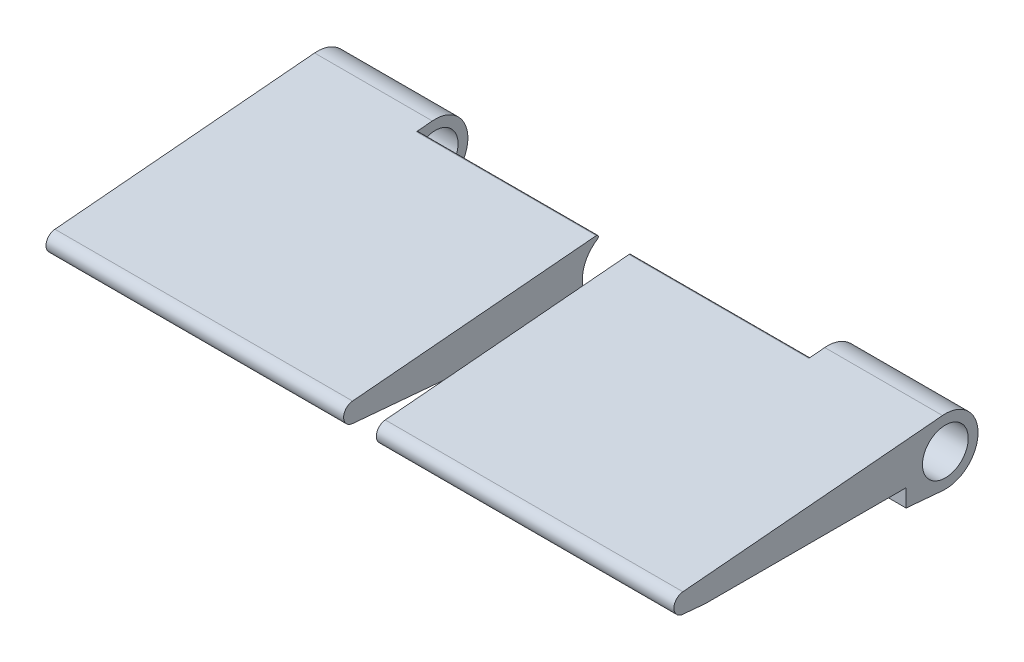
ISO-10303-21;
HEADER;
FILE_DESCRIPTION(('STEP AP214'),'2;1');
FILE_NAME('part.step','',(''),(''),'','','');
FILE_SCHEMA(('AUTOMOTIVE_DESIGN { 1 0 10303 214 1 1 1 1 }'));
ENDSEC;
DATA;
#1=APPLICATION_CONTEXT('core data for automotive mechanical design processes');
#2=APPLICATION_PROTOCOL_DEFINITION('international standard','automotive_design',2000,#1);
#3=PRODUCT_CONTEXT('',#1,'mechanical');
#4=PRODUCT('Part','Part','',(#3));
#5=PRODUCT_RELATED_PRODUCT_CATEGORY('part','',(#4));
#6=PRODUCT_DEFINITION_FORMATION('','',#4);
#7=PRODUCT_DEFINITION_CONTEXT('part definition',#1,'design');
#8=PRODUCT_DEFINITION('design','',#6,#7);
#9=PRODUCT_DEFINITION_SHAPE('','',#8);
#10=(LENGTH_UNIT() NAMED_UNIT(*) SI_UNIT(.MILLI.,.METRE.));
#11=(NAMED_UNIT(*) PLANE_ANGLE_UNIT() SI_UNIT($,.RADIAN.));
#12=(NAMED_UNIT(*) SI_UNIT($,.STERADIAN.) SOLID_ANGLE_UNIT());
#13=UNCERTAINTY_MEASURE_WITH_UNIT(LENGTH_MEASURE(1.E-05),#10,'distance_accuracy_value','');
#14=(GEOMETRIC_REPRESENTATION_CONTEXT(3) GLOBAL_UNCERTAINTY_ASSIGNED_CONTEXT((#13)) GLOBAL_UNIT_ASSIGNED_CONTEXT((#10,
#11,#12)) REPRESENTATION_CONTEXT('',''));
#15=CARTESIAN_POINT('',(0.,0.,0.));
#16=DIRECTION('',(0.,0.,1.));
#17=DIRECTION('',(1.,0.,0.));
#18=AXIS2_PLACEMENT_3D('',#15,#16,#17);
#19=CARTESIAN_POINT('',(32.5,-6.62708288224904,-18.304740975765));
#20=DIRECTION('',(0.,0.996164519544839,-0.0875));
#21=DIRECTION('',(0.,0.0875,0.996164519544839));
#22=AXIS2_PLACEMENT_3D('',#19,#20,#21);
#23=PLANE('',#22);
#24=DIRECTION('',(1.,0.,0.));
#25=VECTOR('',#24,1.);
#26=CARTESIAN_POINT('',(32.5000000000001,-1.8,36.6503298836491));
#27=LINE('',#26,#25);
#28=CARTESIAN_POINT('',(60.,-1.8,36.650329883649));
#29=VERTEX_POINT('',#28);
#30=CARTESIAN_POINT('',(78.,-1.8,36.650329883649));
#31=VERTEX_POINT('',#30);
#32=EDGE_CURVE('E140',#29,#31,#27,.T.);
#33=ORIENTED_EDGE('',*,*,#32,.T.);
#34=DIRECTION('',(0.,-0.0875,-0.996164519544839));
#35=VECTOR('',#34,1.);
#36=CARTESIAN_POINT('',(78.,-6.62708288224904,-18.304740975765));
#37=LINE('',#36,#35);
#38=CARTESIAN_POINT('',(78.,-1.49424677931726,40.13125));
#39=VERTEX_POINT('',#38);
#40=EDGE_CURVE('E158',#39,#31,#37,.T.);
#41=ORIENTED_EDGE('',*,*,#40,.F.);
#42=DIRECTION('',(1.,0.,0.));
#43=VECTOR('',#42,1.);
#44=CARTESIAN_POINT('',(32.5,-1.49424677931726,40.13125));
#45=LINE('',#44,#43);
#46=CARTESIAN_POINT('',(32.5,-1.49424677931726,40.13125));
#47=VERTEX_POINT('',#46);
#48=EDGE_CURVE('E187',#47,#39,#45,.T.);
#49=ORIENTED_EDGE('',*,*,#48,.F.);
#50=DIRECTION('',(0.,-0.0875,-0.996164519544839));
#51=VECTOR('',#50,1.);
#52=CARTESIAN_POINT('',(32.5,-6.62708288224904,-18.304740975765));
#53=LINE('',#52,#51);
#54=CARTESIAN_POINT('',(32.5,-4.76649224523067,2.87759477274962));
#55=VERTEX_POINT('',#54);
#56=EDGE_CURVE('E181',#47,#55,#53,.T.);
#57=ORIENTED_EDGE('',*,*,#56,.T.);
#58=DIRECTION('',(-1.,0.,0.));
#59=VECTOR('',#58,1.);
#60=CARTESIAN_POINT('',(32.5,-4.76649224523067,2.87759477274961));
#61=LINE('',#60,#59);
#62=CARTESIAN_POINT('',(60.,-4.76649224523067,2.87759477274961));
#63=VERTEX_POINT('',#62);
#64=EDGE_CURVE('E200',#63,#55,#61,.T.);
#65=ORIENTED_EDGE('',*,*,#64,.F.);
#66=DIRECTION('',(0.,0.0875,0.996164519544839));
#67=VECTOR('',#66,1.);
#68=CARTESIAN_POINT('',(60.,-6.62708288224904,-18.304740975765));
#69=LINE('',#68,#67);
#70=CARTESIAN_POINT('',(60.,-4.9808225977242,0.437499999999997));
#71=VERTEX_POINT('',#70);
#72=EDGE_CURVE('E203',#71,#63,#69,.T.);
#73=ORIENTED_EDGE('',*,*,#72,.F.);
#74=DIRECTION('',(-1.,0.,0.));
#75=VECTOR('',#74,1.);
#76=CARTESIAN_POINT('',(78.,-4.9808225977242,0.437499999999997));
#77=LINE('',#76,#75);
#78=CARTESIAN_POINT('',(78.,-4.9808225977242,0.437499999999997));
#79=VERTEX_POINT('',#78);
#80=EDGE_CURVE('E167',#79,#71,#77,.T.);
#81=ORIENTED_EDGE('',*,*,#80,.F.);
#82=CARTESIAN_POINT('',(78.,-4.49222985982746,6.));
#83=VERTEX_POINT('',#82);
#84=EDGE_CURVE('E157',#83,#79,#37,.T.);
#85=ORIENTED_EDGE('',*,*,#84,.F.);
#86=DIRECTION('',(-1.,0.,0.));
#87=VECTOR('',#86,1.);
#88=CARTESIAN_POINT('',(32.5,-4.49222985982746,6.));
#89=LINE('',#88,#87);
#90=CARTESIAN_POINT('',(60.,-4.49222985982746,6.));
#91=VERTEX_POINT('',#90);
#92=EDGE_CURVE('E142',#83,#91,#89,.T.);
#93=ORIENTED_EDGE('',*,*,#92,.T.);
#94=DIRECTION('',(0.,0.0875,0.996164519544839));
#95=VECTOR('',#94,1.);
#96=CARTESIAN_POINT('',(60.,-6.62708288224904,-18.304740975765));
#97=LINE('',#96,#95);
#98=EDGE_CURVE('E12',#91,#29,#97,.T.);
#99=ORIENTED_EDGE('',*,*,#98,.T.);
#100=EDGE_LOOP('',(#33,#41,#49,#57,#65,#73,#81,#85,#93,#99));
#101=FACE_BOUND('',#100,.T.);
#102=ADVANCED_FACE('F46',(#101),#23,.F.);
#103=CARTESIAN_POINT('',(78.,0.,-18.886843370319));
#104=DIRECTION('',(-1.,0.,0.));
#105=DIRECTION('',(0.,0.,-1.));
#106=AXIS2_PLACEMENT_3D('',#103,#104,#105);
#107=PLANE('',#106);
#108=CARTESIAN_POINT('',(78.,0.,0.));
#109=DIRECTION('',(1.,0.,0.));
#110=DIRECTION('',(0.,0.,-1.));
#111=AXIS2_PLACEMENT_3D('',#108,#109,#110);
#112=CIRCLE('',#111,3.5);
#113=CARTESIAN_POINT('',(78.,0.,-3.5));
#114=VERTEX_POINT('',#113);
#115=EDGE_CURVE('E164',#114,#114,#112,.T.);
#116=ORIENTED_EDGE('',*,*,#115,.F.);
#117=EDGE_LOOP('',(#116));
#118=FACE_BOUND('',#117,.T.);
#119=DIRECTION('',(0.,0.,-1.));
#120=VECTOR('',#119,1.);
#121=CARTESIAN_POINT('',(78.,-1.8,-18.886843370319));
#122=LINE('',#121,#120);
#123=CARTESIAN_POINT('',(78.,-1.8,6.));
#124=VERTEX_POINT('',#123);
#125=EDGE_CURVE('E54',#31,#124,#122,.T.);
#126=ORIENTED_EDGE('',*,*,#125,.T.);
#127=DIRECTION('',(0.,-1.,0.));
#128=VECTOR('',#127,1.);
#129=CARTESIAN_POINT('',(78.,-6.13028373982871,6.));
#130=LINE('',#129,#128);
#131=EDGE_CURVE('E133',#124,#83,#130,.T.);
#132=ORIENTED_EDGE('',*,*,#131,.T.);
#133=ORIENTED_EDGE('',*,*,#84,.T.);
#134=CARTESIAN_POINT('',(78.,0.,0.));
#135=DIRECTION('',(1.,0.,0.));
#136=DIRECTION('',(0.,0.,-1.));
#137=AXIS2_PLACEMENT_3D('',#134,#135,#136);
#138=CIRCLE('',#137,5.);
#139=CARTESIAN_POINT('',(78.,4.9808225977242,0.437499999999997));
#140=VERTEX_POINT('',#139);
#141=EDGE_CURVE('E161',#79,#140,#138,.T.);
#142=ORIENTED_EDGE('',*,*,#141,.T.);
#143=DIRECTION('',(0.,0.0875,-0.996164519544839));
#144=VECTOR('',#143,1.);
#145=CARTESIAN_POINT('',(78.,6.62708288224904,-18.304740975765));
#146=LINE('',#145,#144);
#147=CARTESIAN_POINT('',(78.,1.49424677931726,40.13125));
#148=VERTEX_POINT('',#147);
#149=EDGE_CURVE('E151',#148,#140,#146,.T.);
#150=ORIENTED_EDGE('',*,*,#149,.F.);
#151=CARTESIAN_POINT('',(78.,0.,40.));
#152=DIRECTION('',(1.,0.,0.));
#153=DIRECTION('',(0.,0.,-1.));
#154=AXIS2_PLACEMENT_3D('',#151,#152,#153);
#155=CIRCLE('',#154,1.5);
#156=EDGE_CURVE('E154',#148,#39,#155,.T.);
#157=ORIENTED_EDGE('',*,*,#156,.T.);
#158=ORIENTED_EDGE('',*,*,#40,.T.);
#159=EDGE_LOOP('',(#126,#132,#133,#142,#150,#157,#158));
#160=FACE_BOUND('',#159,.T.);
#161=ADVANCED_FACE('F218',(#118,#160),#107,.F.);
#162=CARTESIAN_POINT('',(32.5,6.62708288224904,-18.304740975765));
#163=DIRECTION('',(0.,0.996164519544839,0.0875));
#164=DIRECTION('',(0.,-0.0875,0.996164519544839));
#165=AXIS2_PLACEMENT_3D('',#162,#163,#164);
#166=PLANE('',#165);
#167=DIRECTION('',(0.,0.0875,-0.996164519544839));
#168=VECTOR('',#167,1.);
#169=CARTESIAN_POINT('',(32.5,6.62708288224904,-18.304740975765));
#170=LINE('',#169,#168);
#171=CARTESIAN_POINT('',(32.5,1.49424677931726,40.13125));
#172=VERTEX_POINT('',#171);
#173=CARTESIAN_POINT('',(32.5,4.76649224523067,2.87759477274962));
#174=VERTEX_POINT('',#173);
#175=EDGE_CURVE('E176',#172,#174,#170,.T.);
#176=ORIENTED_EDGE('',*,*,#175,.F.);
#177=DIRECTION('',(1.,0.,0.));
#178=VECTOR('',#177,1.);
#179=CARTESIAN_POINT('',(32.5,1.49424677931726,40.13125));
#180=LINE('',#179,#178);
#181=EDGE_CURVE('E192',#172,#148,#180,.T.);
#182=ORIENTED_EDGE('',*,*,#181,.T.);
#183=ORIENTED_EDGE('',*,*,#149,.T.);
#184=DIRECTION('',(-1.,0.,0.));
#185=VECTOR('',#184,1.);
#186=CARTESIAN_POINT('',(78.,4.9808225977242,0.437499999999997));
#187=LINE('',#186,#185);
#188=CARTESIAN_POINT('',(60.,4.9808225977242,0.437499999999997));
#189=VERTEX_POINT('',#188);
#190=EDGE_CURVE('E171',#140,#189,#187,.T.);
#191=ORIENTED_EDGE('',*,*,#190,.T.);
#192=DIRECTION('',(0.,0.0875,-0.996164519544839));
#193=VECTOR('',#192,1.);
#194=CARTESIAN_POINT('',(60.,6.62708288224904,-18.304740975765));
#195=LINE('',#194,#193);
#196=CARTESIAN_POINT('',(60.,4.76649224523067,2.87759477274961));
#197=VERTEX_POINT('',#196);
#198=EDGE_CURVE('E209',#197,#189,#195,.T.);
#199=ORIENTED_EDGE('',*,*,#198,.F.);
#200=DIRECTION('',(1.,0.,0.));
#201=VECTOR('',#200,1.);
#202=CARTESIAN_POINT('',(32.5,4.76649224523067,2.87759477274962));
#203=LINE('',#202,#201);
#204=EDGE_CURVE('E211',#174,#197,#203,.T.);
#205=ORIENTED_EDGE('',*,*,#204,.F.);
#206=EDGE_LOOP('',(#176,#182,#183,#191,#199,#205));
#207=FACE_BOUND('',#206,.T.);
#208=ADVANCED_FACE('F233',(#207),#166,.T.);
#209=CARTESIAN_POINT('',(32.5,0.,40.));
#210=DIRECTION('',(1.,0.,0.));
#211=DIRECTION('',(0.,0.,1.));
#212=AXIS2_PLACEMENT_3D('',#209,#210,#211);
#213=CYLINDRICAL_SURFACE('',#212,1.5);
#214=ORIENTED_EDGE('',*,*,#181,.F.);
#215=CARTESIAN_POINT('',(32.5,0.,40.));
#216=DIRECTION('',(1.,0.,0.));
#217=DIRECTION('',(0.,0.,-1.));
#218=AXIS2_PLACEMENT_3D('',#215,#216,#217);
#219=CIRCLE('',#218,1.5);
#220=EDGE_CURVE('E179',#172,#47,#219,.T.);
#221=ORIENTED_EDGE('',*,*,#220,.T.);
#222=ORIENTED_EDGE('',*,*,#48,.T.);
#223=ORIENTED_EDGE('',*,*,#156,.F.);
#224=EDGE_LOOP('',(#214,#221,#222,#223));
#225=FACE_BOUND('',#224,.T.);
#226=ADVANCED_FACE('F237',(#225),#213,.T.);
#227=CARTESIAN_POINT('',(32.5,0.,0.));
#228=DIRECTION('',(1.,0.,0.));
#229=DIRECTION('',(0.,0.,1.));
#230=AXIS2_PLACEMENT_3D('',#227,#228,#229);
#231=CYLINDRICAL_SURFACE('',#230,5.);
#232=CARTESIAN_POINT('',(32.5,0.,0.));
#233=DIRECTION('',(1.,0.,0.));
#234=DIRECTION('',(0.,0.,-1.));
#235=AXIS2_PLACEMENT_3D('',#232,#233,#234);
#236=CIRCLE('',#235,5.);
#237=CARTESIAN_POINT('',(32.5,4.21475744279926,2.68994789882039));
#238=VERTEX_POINT('',#237);
#239=CARTESIAN_POINT('',(32.5,-4.21475744279926,2.68994789882039));
#240=VERTEX_POINT('',#239);
#241=EDGE_CURVE('E184',#238,#240,#236,.T.);
#242=ORIENTED_EDGE('',*,*,#241,.F.);
#243=DIRECTION('',(1.,0.,0.));
#244=VECTOR('',#243,1.);
#245=CARTESIAN_POINT('',(32.5,4.21475744279926,2.68994789882039));
#246=LINE('',#245,#244);
#247=CARTESIAN_POINT('',(60.,4.21475744279926,2.68994789882039));
#248=VERTEX_POINT('',#247);
#249=EDGE_CURVE('E194',#248,#238,#246,.F.);
#250=ORIENTED_EDGE('',*,*,#249,.F.);
#251=CARTESIAN_POINT('',(60.,0.,0.));
#252=DIRECTION('',(1.,0.,0.));
#253=DIRECTION('',(0.,0.,-1.));
#254=AXIS2_PLACEMENT_3D('',#251,#252,#253);
#255=CIRCLE('',#254,5.);
#256=CARTESIAN_POINT('',(60.,-4.21475744279926,2.68994789882039));
#257=VERTEX_POINT('',#256);
#258=EDGE_CURVE('E174',#248,#257,#255,.T.);
#259=ORIENTED_EDGE('',*,*,#258,.T.);
#260=DIRECTION('',(1.,0.,0.));
#261=VECTOR('',#260,1.);
#262=CARTESIAN_POINT('',(32.5,-4.21475744279926,2.68994789882039));
#263=LINE('',#262,#261);
#264=EDGE_CURVE('E197',#240,#257,#263,.T.);
#265=ORIENTED_EDGE('',*,*,#264,.F.);
#266=EDGE_LOOP('',(#242,#250,#259,#265));
#267=FACE_BOUND('',#266,.T.);
#268=ADVANCED_FACE('F270',(#267),#231,.F.);
#269=CARTESIAN_POINT('',(32.5,0.,-18.886843370319));
#270=DIRECTION('',(-1.,0.,0.));
#271=DIRECTION('',(0.,0.,-1.));
#272=AXIS2_PLACEMENT_3D('',#269,#270,#271);
#273=PLANE('',#272);
#274=ORIENTED_EDGE('',*,*,#56,.F.);
#275=ORIENTED_EDGE('',*,*,#220,.F.);
#276=ORIENTED_EDGE('',*,*,#175,.T.);
#277=CARTESIAN_POINT('',(32.5,4.46764288936722,2.85134477274961));
#278=DIRECTION('',(1.,0.,0.));
#279=DIRECTION('',(0.,0.,-1.));
#280=AXIS2_PLACEMENT_3D('',#277,#278,#279);
#281=CIRCLE('',#280,0.3);
#282=EDGE_CURVE('E205',#238,#174,#281,.T.);
#283=ORIENTED_EDGE('',*,*,#282,.F.);
#284=ORIENTED_EDGE('',*,*,#241,.T.);
#285=CARTESIAN_POINT('',(32.5,-4.46764288936722,2.85134477274961));
#286=DIRECTION('',(1.,0.,0.));
#287=DIRECTION('',(0.,0.,-1.));
#288=AXIS2_PLACEMENT_3D('',#285,#286,#287);
#289=CIRCLE('',#288,0.3);
#290=EDGE_CURVE('E207',#55,#240,#289,.T.);
#291=ORIENTED_EDGE('',*,*,#290,.F.);
#292=EDGE_LOOP('',(#274,#275,#276,#283,#284,#291));
#293=FACE_BOUND('',#292,.T.);
#294=ADVANCED_FACE('F241',(#293),#273,.T.);
#295=CARTESIAN_POINT('',(78.,0.,0.));
#296=DIRECTION('',(-1.,0.,0.));
#297=DIRECTION('',(0.,0.,-1.));
#298=AXIS2_PLACEMENT_3D('',#295,#296,#297);
#299=CYLINDRICAL_SURFACE('',#298,5.);
#300=CARTESIAN_POINT('',(60.,0.,0.));
#301=DIRECTION('',(1.,0.,0.));
#302=DIRECTION('',(0.,0.,-1.));
#303=AXIS2_PLACEMENT_3D('',#300,#301,#302);
#304=CIRCLE('',#303,5.);
#305=EDGE_CURVE('E69',#71,#189,#304,.T.);
#306=ORIENTED_EDGE('',*,*,#305,.T.);
#307=ORIENTED_EDGE('',*,*,#190,.F.);
#308=ORIENTED_EDGE('',*,*,#141,.F.);
#309=ORIENTED_EDGE('',*,*,#80,.T.);
#310=EDGE_LOOP('',(#306,#307,#308,#309));
#311=FACE_BOUND('',#310,.T.);
#312=ADVANCED_FACE('F229',(#311),#299,.T.);
#313=CARTESIAN_POINT('',(78.,0.,0.));
#314=DIRECTION('',(-1.,0.,0.));
#315=DIRECTION('',(0.,0.,-1.));
#316=AXIS2_PLACEMENT_3D('',#313,#314,#315);
#317=CYLINDRICAL_SURFACE('',#316,3.5);
#318=ORIENTED_EDGE('',*,*,#115,.T.);
#319=EDGE_LOOP('',(#318));
#320=FACE_BOUND('',#319,.T.);
#321=CARTESIAN_POINT('',(60.,0.,0.));
#322=DIRECTION('',(1.,0.,0.));
#323=DIRECTION('',(0.,0.,-1.));
#324=AXIS2_PLACEMENT_3D('',#321,#322,#323);
#325=CIRCLE('',#324,3.5);
#326=CARTESIAN_POINT('',(60.,0.,-3.5));
#327=VERTEX_POINT('',#326);
#328=EDGE_CURVE('E155',#327,#327,#325,.T.);
#329=ORIENTED_EDGE('',*,*,#328,.F.);
#330=EDGE_LOOP('',(#329));
#331=FACE_BOUND('',#330,.T.);
#332=ADVANCED_FACE('F250',(#320,#331),#317,.F.);
#333=CARTESIAN_POINT('',(60.,0.,-18.886843370319));
#334=DIRECTION('',(-1.,0.,0.));
#335=DIRECTION('',(0.,0.,-1.));
#336=AXIS2_PLACEMENT_3D('',#333,#334,#335);
#337=PLANE('',#336);
#338=ORIENTED_EDGE('',*,*,#305,.F.);
#339=ORIENTED_EDGE('',*,*,#72,.T.);
#340=CARTESIAN_POINT('',(60.,-4.46764288936722,2.85134477274961));
#341=DIRECTION('',(1.,0.,0.));
#342=DIRECTION('',(0.,0.,-1.));
#343=AXIS2_PLACEMENT_3D('',#340,#341,#342);
#344=CIRCLE('',#343,0.3);
#345=EDGE_CURVE('E214',#257,#63,#344,.F.);
#346=ORIENTED_EDGE('',*,*,#345,.F.);
#347=ORIENTED_EDGE('',*,*,#258,.F.);
#348=CARTESIAN_POINT('',(60.,4.46764288936722,2.85134477274961));
#349=DIRECTION('',(1.,0.,0.));
#350=DIRECTION('',(0.,0.,-1.));
#351=AXIS2_PLACEMENT_3D('',#348,#349,#350);
#352=CIRCLE('',#351,0.3);
#353=EDGE_CURVE('E216',#197,#248,#352,.F.);
#354=ORIENTED_EDGE('',*,*,#353,.F.);
#355=ORIENTED_EDGE('',*,*,#198,.T.);
#356=EDGE_LOOP('',(#338,#339,#346,#347,#354,#355));
#357=FACE_BOUND('',#356,.T.);
#358=ORIENTED_EDGE('',*,*,#328,.T.);
#359=EDGE_LOOP('',(#358));
#360=FACE_BOUND('',#359,.T.);
#361=ADVANCED_FACE('F247',(#357,#360),#337,.T.);
#362=CARTESIAN_POINT('',(32.5,-4.46764288936722,2.85134477274961));
#363=DIRECTION('',(1.,0.,0.));
#364=DIRECTION('',(0.,0.,1.));
#365=AXIS2_PLACEMENT_3D('',#362,#363,#364);
#366=CYLINDRICAL_SURFACE('',#365,0.3);
#367=ORIENTED_EDGE('',*,*,#290,.T.);
#368=ORIENTED_EDGE('',*,*,#264,.T.);
#369=ORIENTED_EDGE('',*,*,#345,.T.);
#370=ORIENTED_EDGE('',*,*,#64,.T.);
#371=EDGE_LOOP('',(#367,#368,#369,#370));
#372=FACE_BOUND('',#371,.T.);
#373=ADVANCED_FACE('F245',(#372),#366,.T.);
#374=CARTESIAN_POINT('',(32.5,4.46764288936722,2.85134477274961));
#375=DIRECTION('',(1.,0.,0.));
#376=DIRECTION('',(0.,0.,1.));
#377=AXIS2_PLACEMENT_3D('',#374,#375,#376);
#378=CYLINDRICAL_SURFACE('',#377,0.3);
#379=ORIENTED_EDGE('',*,*,#282,.T.);
#380=ORIENTED_EDGE('',*,*,#204,.T.);
#381=ORIENTED_EDGE('',*,*,#353,.T.);
#382=ORIENTED_EDGE('',*,*,#249,.T.);
#383=EDGE_LOOP('',(#379,#380,#381,#382));
#384=FACE_BOUND('',#383,.T.);
#385=ADVANCED_FACE('F48',(#384),#378,.T.);
#386=CARTESIAN_POINT('',(60.,-6.13028373982871,54.));
#387=DIRECTION('',(1.,0.,0.));
#388=DIRECTION('',(0.,0.,1.));
#389=AXIS2_PLACEMENT_3D('',#386,#387,#388);
#390=PLANE('',#389);
#391=ORIENTED_EDGE('',*,*,#98,.F.);
#392=DIRECTION('',(0.,1.,0.));
#393=VECTOR('',#392,1.);
#394=CARTESIAN_POINT('',(60.,-6.13028373982871,6.));
#395=LINE('',#394,#393);
#396=CARTESIAN_POINT('',(60.,-1.8,6.));
#397=VERTEX_POINT('',#396);
#398=EDGE_CURVE('E131',#91,#397,#395,.T.);
#399=ORIENTED_EDGE('',*,*,#398,.T.);
#400=DIRECTION('',(0.,0.,-1.));
#401=VECTOR('',#400,1.);
#402=CARTESIAN_POINT('',(60.,-1.8,54.));
#403=LINE('',#402,#401);
#404=EDGE_CURVE('E137',#29,#397,#403,.T.);
#405=ORIENTED_EDGE('',*,*,#404,.F.);
#406=EDGE_LOOP('',(#391,#399,#405));
#407=FACE_BOUND('',#406,.T.);
#408=ADVANCED_FACE('F144',(#407),#390,.T.);
#409=CARTESIAN_POINT('',(60.,-1.8,54.));
#410=DIRECTION('',(0.,-1.,0.));
#411=DIRECTION('',(-1.,0.,0.));
#412=AXIS2_PLACEMENT_3D('',#409,#410,#411);
#413=PLANE('',#412);
#414=ORIENTED_EDGE('',*,*,#32,.F.);
#415=ORIENTED_EDGE('',*,*,#404,.T.);
#416=DIRECTION('',(1.,0.,0.));
#417=VECTOR('',#416,1.);
#418=CARTESIAN_POINT('',(60.,-1.8,6.));
#419=LINE('',#418,#417);
#420=EDGE_CURVE('E61',#397,#124,#419,.T.);
#421=ORIENTED_EDGE('',*,*,#420,.T.);
#422=ORIENTED_EDGE('',*,*,#125,.F.);
#423=EDGE_LOOP('',(#414,#415,#421,#422));
#424=FACE_BOUND('',#423,.T.);
#425=ADVANCED_FACE('F138',(#424),#413,.T.);
#426=CARTESIAN_POINT('',(60.,-1.8,6.));
#427=DIRECTION('',(0.,0.,1.));
#428=DIRECTION('',(-1.,0.,0.));
#429=AXIS2_PLACEMENT_3D('',#426,#427,#428);
#430=PLANE('',#429);
#431=ORIENTED_EDGE('',*,*,#92,.F.);
#432=ORIENTED_EDGE('',*,*,#131,.F.);
#433=ORIENTED_EDGE('',*,*,#420,.F.);
#434=ORIENTED_EDGE('',*,*,#398,.F.);
#435=EDGE_LOOP('',(#431,#432,#433,#434));
#436=FACE_BOUND('',#435,.T.);
#437=ADVANCED_FACE('F129',(#436),#430,.T.);
#438=CLOSED_SHELL('',(#102,#161,#208,#226,#268,#294,#312,#332,#361,#373,#385,#408,#425,#437));
#439=MANIFOLD_SOLID_BREP('B2',#438);
#440=CARTESIAN_POINT('',(27.5,-6.62708288224904,-18.304740975765));
#441=DIRECTION('',(0.,0.996164519544839,-0.0875));
#442=DIRECTION('',(0.,0.0875,0.996164519544839));
#443=AXIS2_PLACEMENT_3D('',#440,#441,#442);
#444=PLANE('',#443);
#445=DIRECTION('',(-1.,0.,0.));
#446=VECTOR('',#445,1.);
#447=CARTESIAN_POINT('',(27.4999999999999,-1.8,36.6503298836491));
#448=LINE('',#447,#446);
#449=CARTESIAN_POINT('',(0.,-1.8,36.650329883649));
#450=VERTEX_POINT('',#449);
#451=CARTESIAN_POINT('',(-18.,-1.8,36.650329883649));
#452=VERTEX_POINT('',#451);
#453=EDGE_CURVE('E498',#450,#452,#448,.T.);
#454=ORIENTED_EDGE('',*,*,#453,.F.);
#455=DIRECTION('',(0.,0.0875,0.996164519544839));
#456=VECTOR('',#455,1.);
#457=CARTESIAN_POINT('',(0.,-6.62708288224904,-18.304740975765));
#458=LINE('',#457,#456);
#459=CARTESIAN_POINT('',(0.,-4.49222985982746,6.));
#460=VERTEX_POINT('',#459);
#461=EDGE_CURVE('E44',#460,#450,#458,.T.);
#462=ORIENTED_EDGE('',*,*,#461,.F.);
#463=DIRECTION('',(1.,0.,0.));
#464=VECTOR('',#463,1.);
#465=CARTESIAN_POINT('',(27.5,-4.49222985982746,6.));
#466=LINE('',#465,#464);
#467=CARTESIAN_POINT('',(-18.,-4.49222985982746,6.));
#468=VERTEX_POINT('',#467);
#469=EDGE_CURVE('E485',#468,#460,#466,.T.);
#470=ORIENTED_EDGE('',*,*,#469,.F.);
#471=DIRECTION('',(0.,-0.0875,-0.996164519544839));
#472=VECTOR('',#471,1.);
#473=CARTESIAN_POINT('',(-18.,-6.62708288224904,-18.304740975765));
#474=LINE('',#473,#472);
#475=CARTESIAN_POINT('',(-18.,-4.9808225977242,0.437499999999997));
#476=VERTEX_POINT('',#475);
#477=EDGE_CURVE('E507',#468,#476,#474,.T.);
#478=ORIENTED_EDGE('',*,*,#477,.T.);
#479=DIRECTION('',(1.,0.,0.));
#480=VECTOR('',#479,1.);
#481=CARTESIAN_POINT('',(-18.,-4.9808225977242,0.437499999999997));
#482=LINE('',#481,#480);
#483=CARTESIAN_POINT('',(0.,-4.9808225977242,0.437499999999997));
#484=VERTEX_POINT('',#483);
#485=EDGE_CURVE('E517',#476,#484,#482,.T.);
#486=ORIENTED_EDGE('',*,*,#485,.T.);
#487=DIRECTION('',(0.,0.0875,0.996164519544839));
#488=VECTOR('',#487,1.);
#489=CARTESIAN_POINT('',(0.,-6.62708288224904,-18.304740975765));
#490=LINE('',#489,#488);
#491=CARTESIAN_POINT('',(0.,-4.76649224523067,2.87759477274961));
#492=VERTEX_POINT('',#491);
#493=EDGE_CURVE('E418',#484,#492,#490,.T.);
#494=ORIENTED_EDGE('',*,*,#493,.T.);
#495=DIRECTION('',(1.,0.,0.));
#496=VECTOR('',#495,1.);
#497=CARTESIAN_POINT('',(27.5,-4.76649224523067,2.87759477274961));
#498=LINE('',#497,#496);
#499=CARTESIAN_POINT('',(27.5,-4.76649224523067,2.87759477274962));
#500=VERTEX_POINT('',#499);
#501=EDGE_CURVE('E548',#492,#500,#498,.T.);
#502=ORIENTED_EDGE('',*,*,#501,.T.);
#503=DIRECTION('',(0.,-0.0875,-0.996164519544839));
#504=VECTOR('',#503,1.);
#505=CARTESIAN_POINT('',(27.5,-6.62708288224904,-18.304740975765));
#506=LINE('',#505,#504);
#507=CARTESIAN_POINT('',(27.5,-1.49424677931726,40.13125));
#508=VERTEX_POINT('',#507);
#509=EDGE_CURVE('E531',#508,#500,#506,.T.);
#510=ORIENTED_EDGE('',*,*,#509,.F.);
#511=DIRECTION('',(-1.,0.,0.));
#512=VECTOR('',#511,1.);
#513=CARTESIAN_POINT('',(27.5,-1.49424677931726,40.13125));
#514=LINE('',#513,#512);
#515=CARTESIAN_POINT('',(-18.,-1.49424677931726,40.13125));
#516=VERTEX_POINT('',#515);
#517=EDGE_CURVE('E537',#508,#516,#514,.T.);
#518=ORIENTED_EDGE('',*,*,#517,.T.);
#519=EDGE_CURVE('E508',#516,#452,#474,.T.);
#520=ORIENTED_EDGE('',*,*,#519,.T.);
#521=EDGE_LOOP('',(#454,#462,#470,#478,#486,#494,#502,#510,#518,#520));
#522=FACE_BOUND('',#521,.T.);
#523=ADVANCED_FACE('F395',(#522),#444,.F.);
#524=CARTESIAN_POINT('',(-18.,0.,-18.886843370319));
#525=DIRECTION('',(1.,0.,0.));
#526=DIRECTION('',(0.,0.,-1.));
#527=AXIS2_PLACEMENT_3D('',#524,#525,#526);
#528=PLANE('',#527);
#529=CARTESIAN_POINT('',(-18.,0.,0.));
#530=DIRECTION('',(1.,0.,0.));
#531=DIRECTION('',(0.,0.,-1.));
#532=AXIS2_PLACEMENT_3D('',#529,#530,#531);
#533=CIRCLE('',#532,3.5);
#534=CARTESIAN_POINT('',(-18.,0.,-3.5));
#535=VERTEX_POINT('',#534);
#536=EDGE_CURVE('E514',#535,#535,#533,.T.);
#537=ORIENTED_EDGE('',*,*,#536,.T.);
#538=EDGE_LOOP('',(#537));
#539=FACE_BOUND('',#538,.T.);
#540=DIRECTION('',(0.,0.,-1.));
#541=VECTOR('',#540,1.);
#542=CARTESIAN_POINT('',(-18.,-1.8,-18.886843370319));
#543=LINE('',#542,#541);
#544=CARTESIAN_POINT('',(-18.,-1.8,6.));
#545=VERTEX_POINT('',#544);
#546=EDGE_CURVE('E403',#452,#545,#543,.T.);
#547=ORIENTED_EDGE('',*,*,#546,.F.);
#548=ORIENTED_EDGE('',*,*,#519,.F.);
#549=CARTESIAN_POINT('',(-18.,0.,40.));
#550=DIRECTION('',(1.,0.,0.));
#551=DIRECTION('',(0.,0.,-1.));
#552=AXIS2_PLACEMENT_3D('',#549,#550,#551);
#553=CIRCLE('',#552,1.5);
#554=CARTESIAN_POINT('',(-18.,1.49424677931726,40.13125));
#555=VERTEX_POINT('',#554);
#556=EDGE_CURVE('E503',#555,#516,#553,.T.);
#557=ORIENTED_EDGE('',*,*,#556,.F.);
#558=DIRECTION('',(0.,0.0875,-0.996164519544839));
#559=VECTOR('',#558,1.);
#560=CARTESIAN_POINT('',(-18.,6.62708288224904,-18.304740975765));
#561=LINE('',#560,#559);
#562=CARTESIAN_POINT('',(-18.,4.9808225977242,0.437499999999997));
#563=VERTEX_POINT('',#562);
#564=EDGE_CURVE('E501',#555,#563,#561,.T.);
#565=ORIENTED_EDGE('',*,*,#564,.T.);
#566=CARTESIAN_POINT('',(-18.,0.,0.));
#567=DIRECTION('',(1.,0.,0.));
#568=DIRECTION('',(0.,0.,-1.));
#569=AXIS2_PLACEMENT_3D('',#566,#567,#568);
#570=CIRCLE('',#569,5.);
#571=EDGE_CURVE('E511',#476,#563,#570,.T.);
#572=ORIENTED_EDGE('',*,*,#571,.F.);
#573=ORIENTED_EDGE('',*,*,#477,.F.);
#574=DIRECTION('',(0.,-1.,0.));
#575=VECTOR('',#574,1.);
#576=CARTESIAN_POINT('',(-18.,-6.13028373982871,6.));
#577=LINE('',#576,#575);
#578=EDGE_CURVE('E486',#545,#468,#577,.T.);
#579=ORIENTED_EDGE('',*,*,#578,.F.);
#580=EDGE_LOOP('',(#547,#548,#557,#565,#572,#573,#579));
#581=FACE_BOUND('',#580,.T.);
#582=ADVANCED_FACE('F600',(#539,#581),#528,.F.);
#583=CARTESIAN_POINT('',(27.5,6.62708288224904,-18.304740975765));
#584=DIRECTION('',(0.,0.996164519544839,0.0875));
#585=DIRECTION('',(0.,-0.0875,0.996164519544839));
#586=AXIS2_PLACEMENT_3D('',#583,#584,#585);
#587=PLANE('',#586);
#588=DIRECTION('',(0.,0.0875,-0.996164519544839));
#589=VECTOR('',#588,1.);
#590=CARTESIAN_POINT('',(27.5,6.62708288224904,-18.304740975765));
#591=LINE('',#590,#589);
#592=CARTESIAN_POINT('',(27.5,1.49424677931726,40.13125));
#593=VERTEX_POINT('',#592);
#594=CARTESIAN_POINT('',(27.5,4.76649224523067,2.87759477274962));
#595=VERTEX_POINT('',#594);
#596=EDGE_CURVE('E526',#593,#595,#591,.T.);
#597=ORIENTED_EDGE('',*,*,#596,.T.);
#598=DIRECTION('',(-1.,0.,0.));
#599=VECTOR('',#598,1.);
#600=CARTESIAN_POINT('',(27.5,4.76649224523067,2.87759477274962));
#601=LINE('',#600,#599);
#602=CARTESIAN_POINT('',(0.,4.76649224523067,2.87759477274961));
#603=VERTEX_POINT('',#602);
#604=EDGE_CURVE('E557',#595,#603,#601,.T.);
#605=ORIENTED_EDGE('',*,*,#604,.T.);
#606=DIRECTION('',(0.,0.0875,-0.996164519544839));
#607=VECTOR('',#606,1.);
#608=CARTESIAN_POINT('',(0.,6.62708288224904,-18.304740975765));
#609=LINE('',#608,#607);
#610=CARTESIAN_POINT('',(0.,4.9808225977242,0.437499999999997));
#611=VERTEX_POINT('',#610);
#612=EDGE_CURVE('E555',#603,#611,#609,.T.);
#613=ORIENTED_EDGE('',*,*,#612,.T.);
#614=DIRECTION('',(1.,0.,0.));
#615=VECTOR('',#614,1.);
#616=CARTESIAN_POINT('',(-18.,4.9808225977242,0.437499999999997));
#617=LINE('',#616,#615);
#618=EDGE_CURVE('E521',#563,#611,#617,.T.);
#619=ORIENTED_EDGE('',*,*,#618,.F.);
#620=ORIENTED_EDGE('',*,*,#564,.F.);
#621=DIRECTION('',(-1.,0.,0.));
#622=VECTOR('',#621,1.);
#623=CARTESIAN_POINT('',(27.5,1.49424677931726,40.13125));
#624=LINE('',#623,#622);
#625=EDGE_CURVE('E541',#593,#555,#624,.T.);
#626=ORIENTED_EDGE('',*,*,#625,.F.);
#627=EDGE_LOOP('',(#597,#605,#613,#619,#620,#626));
#628=FACE_BOUND('',#627,.T.);
#629=ADVANCED_FACE('F579',(#628),#587,.T.);
#630=CARTESIAN_POINT('',(27.5,0.,40.));
#631=DIRECTION('',(-1.,0.,0.));
#632=DIRECTION('',(0.,0.,1.));
#633=AXIS2_PLACEMENT_3D('',#630,#631,#632);
#634=CYLINDRICAL_SURFACE('',#633,1.5);
#635=ORIENTED_EDGE('',*,*,#625,.T.);
#636=ORIENTED_EDGE('',*,*,#556,.T.);
#637=ORIENTED_EDGE('',*,*,#517,.F.);
#638=CARTESIAN_POINT('',(27.5,0.,40.));
#639=DIRECTION('',(1.,0.,0.));
#640=DIRECTION('',(0.,0.,-1.));
#641=AXIS2_PLACEMENT_3D('',#638,#639,#640);
#642=CIRCLE('',#641,1.5);
#643=EDGE_CURVE('E529',#593,#508,#642,.T.);
#644=ORIENTED_EDGE('',*,*,#643,.F.);
#645=EDGE_LOOP('',(#635,#636,#637,#644));
#646=FACE_BOUND('',#645,.T.);
#647=ADVANCED_FACE('F586',(#646),#634,.T.);
#648=CARTESIAN_POINT('',(27.5,0.,0.));
#649=DIRECTION('',(-1.,0.,0.));
#650=DIRECTION('',(0.,0.,1.));
#651=AXIS2_PLACEMENT_3D('',#648,#649,#650);
#652=CYLINDRICAL_SURFACE('',#651,5.);
#653=CARTESIAN_POINT('',(27.5,0.,0.));
#654=DIRECTION('',(1.,0.,0.));
#655=DIRECTION('',(0.,0.,-1.));
#656=AXIS2_PLACEMENT_3D('',#653,#654,#655);
#657=CIRCLE('',#656,5.);
#658=CARTESIAN_POINT('',(27.5,4.21475744279926,2.68994789882039));
#659=VERTEX_POINT('',#658);
#660=CARTESIAN_POINT('',(27.5,-4.21475744279926,2.68994789882039));
#661=VERTEX_POINT('',#660);
#662=EDGE_CURVE('E534',#659,#661,#657,.T.);
#663=ORIENTED_EDGE('',*,*,#662,.T.);
#664=DIRECTION('',(-1.,0.,0.));
#665=VECTOR('',#664,1.);
#666=CARTESIAN_POINT('',(27.5,-4.21475744279926,2.68994789882039));
#667=LINE('',#666,#665);
#668=CARTESIAN_POINT('',(0.,-4.21475744279926,2.68994789882039));
#669=VERTEX_POINT('',#668);
#670=EDGE_CURVE('E545',#661,#669,#667,.T.);
#671=ORIENTED_EDGE('',*,*,#670,.T.);
#672=CARTESIAN_POINT('',(0.,0.,0.));
#673=DIRECTION('',(1.,0.,0.));
#674=DIRECTION('',(0.,0.,-1.));
#675=AXIS2_PLACEMENT_3D('',#672,#673,#674);
#676=CIRCLE('',#675,5.);
#677=CARTESIAN_POINT('',(0.,4.21475744279926,2.68994789882039));
#678=VERTEX_POINT('',#677);
#679=EDGE_CURVE('E524',#678,#669,#676,.T.);
#680=ORIENTED_EDGE('',*,*,#679,.F.);
#681=DIRECTION('',(-1.,0.,0.));
#682=VECTOR('',#681,1.);
#683=CARTESIAN_POINT('',(27.5,4.21475744279926,2.68994789882039));
#684=LINE('',#683,#682);
#685=EDGE_CURVE('E543',#678,#659,#684,.F.);
#686=ORIENTED_EDGE('',*,*,#685,.T.);
#687=EDGE_LOOP('',(#663,#671,#680,#686));
#688=FACE_BOUND('',#687,.T.);
#689=ADVANCED_FACE('F571',(#688),#652,.F.);
#690=CARTESIAN_POINT('',(27.5,0.,-18.886843370319));
#691=DIRECTION('',(1.,0.,0.));
#692=DIRECTION('',(0.,0.,-1.));
#693=AXIS2_PLACEMENT_3D('',#690,#691,#692);
#694=PLANE('',#693);
#695=ORIENTED_EDGE('',*,*,#509,.T.);
#696=CARTESIAN_POINT('',(27.5,-4.46764288936722,2.85134477274961));
#697=DIRECTION('',(1.,0.,0.));
#698=DIRECTION('',(0.,0.,-1.));
#699=AXIS2_PLACEMENT_3D('',#696,#697,#698);
#700=CIRCLE('',#699,0.3);
#701=EDGE_CURVE('E553',#500,#661,#700,.T.);
#702=ORIENTED_EDGE('',*,*,#701,.T.);
#703=ORIENTED_EDGE('',*,*,#662,.F.);
#704=CARTESIAN_POINT('',(27.5,4.46764288936722,2.85134477274961));
#705=DIRECTION('',(1.,0.,0.));
#706=DIRECTION('',(0.,0.,-1.));
#707=AXIS2_PLACEMENT_3D('',#704,#705,#706);
#708=CIRCLE('',#707,0.3);
#709=EDGE_CURVE('E551',#659,#595,#708,.T.);
#710=ORIENTED_EDGE('',*,*,#709,.T.);
#711=ORIENTED_EDGE('',*,*,#596,.F.);
#712=ORIENTED_EDGE('',*,*,#643,.T.);
#713=EDGE_LOOP('',(#695,#702,#703,#710,#711,#712));
#714=FACE_BOUND('',#713,.T.);
#715=ADVANCED_FACE('F577',(#714),#694,.T.);
#716=CARTESIAN_POINT('',(-18.,0.,0.));
#717=DIRECTION('',(1.,0.,0.));
#718=DIRECTION('',(0.,0.,-1.));
#719=AXIS2_PLACEMENT_3D('',#716,#717,#718);
#720=CYLINDRICAL_SURFACE('',#719,5.);
#721=CARTESIAN_POINT('',(0.,0.,0.));
#722=DIRECTION('',(1.,0.,0.));
#723=DIRECTION('',(0.,0.,-1.));
#724=AXIS2_PLACEMENT_3D('',#721,#722,#723);
#725=CIRCLE('',#724,5.);
#726=EDGE_CURVE('E500',#484,#611,#725,.T.);
#727=ORIENTED_EDGE('',*,*,#726,.F.);
#728=ORIENTED_EDGE('',*,*,#485,.F.);
#729=ORIENTED_EDGE('',*,*,#571,.T.);
#730=ORIENTED_EDGE('',*,*,#618,.T.);
#731=EDGE_LOOP('',(#727,#728,#729,#730));
#732=FACE_BOUND('',#731,.T.);
#733=ADVANCED_FACE('F598',(#732),#720,.T.);
#734=CARTESIAN_POINT('',(-18.,0.,0.));
#735=DIRECTION('',(1.,0.,0.));
#736=DIRECTION('',(0.,0.,-1.));
#737=AXIS2_PLACEMENT_3D('',#734,#735,#736);
#738=CYLINDRICAL_SURFACE('',#737,3.5);
#739=ORIENTED_EDGE('',*,*,#536,.F.);
#740=EDGE_LOOP('',(#739));
#741=FACE_BOUND('',#740,.T.);
#742=CARTESIAN_POINT('',(0.,0.,0.));
#743=DIRECTION('',(1.,0.,0.));
#744=DIRECTION('',(0.,0.,-1.));
#745=AXIS2_PLACEMENT_3D('',#742,#743,#744);
#746=CIRCLE('',#745,3.5);
#747=CARTESIAN_POINT('',(0.,0.,-3.5));
#748=VERTEX_POINT('',#747);
#749=EDGE_CURVE('E504',#748,#748,#746,.T.);
#750=ORIENTED_EDGE('',*,*,#749,.T.);
#751=EDGE_LOOP('',(#750));
#752=FACE_BOUND('',#751,.T.);
#753=ADVANCED_FACE('F616',(#741,#752),#738,.F.);
#754=CARTESIAN_POINT('',(0.,0.,-18.886843370319));
#755=DIRECTION('',(1.,0.,0.));
#756=DIRECTION('',(0.,0.,-1.));
#757=AXIS2_PLACEMENT_3D('',#754,#755,#756);
#758=PLANE('',#757);
#759=ORIENTED_EDGE('',*,*,#726,.T.);
#760=ORIENTED_EDGE('',*,*,#612,.F.);
#761=CARTESIAN_POINT('',(0.,4.46764288936722,2.85134477274961));
#762=DIRECTION('',(1.,0.,0.));
#763=DIRECTION('',(0.,0.,-1.));
#764=AXIS2_PLACEMENT_3D('',#761,#762,#763);
#765=CIRCLE('',#764,0.3);
#766=EDGE_CURVE('E562',#603,#678,#765,.F.);
#767=ORIENTED_EDGE('',*,*,#766,.T.);
#768=ORIENTED_EDGE('',*,*,#679,.T.);
#769=CARTESIAN_POINT('',(0.,-4.46764288936722,2.85134477274961));
#770=DIRECTION('',(1.,0.,0.));
#771=DIRECTION('',(0.,0.,-1.));
#772=AXIS2_PLACEMENT_3D('',#769,#770,#771);
#773=CIRCLE('',#772,0.3);
#774=EDGE_CURVE('E560',#669,#492,#773,.F.);
#775=ORIENTED_EDGE('',*,*,#774,.T.);
#776=ORIENTED_EDGE('',*,*,#493,.F.);
#777=EDGE_LOOP('',(#759,#760,#767,#768,#775,#776));
#778=FACE_BOUND('',#777,.T.);
#779=ORIENTED_EDGE('',*,*,#749,.F.);
#780=EDGE_LOOP('',(#779));
#781=FACE_BOUND('',#780,.T.);
#782=ADVANCED_FACE('F565',(#778,#781),#758,.T.);
#783=CARTESIAN_POINT('',(27.5,-4.46764288936722,2.85134477274961));
#784=DIRECTION('',(-1.,0.,0.));
#785=DIRECTION('',(0.,0.,1.));
#786=AXIS2_PLACEMENT_3D('',#783,#784,#785);
#787=CYLINDRICAL_SURFACE('',#786,0.3);
#788=ORIENTED_EDGE('',*,*,#701,.F.);
#789=ORIENTED_EDGE('',*,*,#501,.F.);
#790=ORIENTED_EDGE('',*,*,#774,.F.);
#791=ORIENTED_EDGE('',*,*,#670,.F.);
#792=EDGE_LOOP('',(#788,#789,#790,#791));
#793=FACE_BOUND('',#792,.T.);
#794=ADVANCED_FACE('F592',(#793),#787,.T.);
#795=CARTESIAN_POINT('',(27.5,4.46764288936722,2.85134477274961));
#796=DIRECTION('',(-1.,0.,0.));
#797=DIRECTION('',(0.,0.,1.));
#798=AXIS2_PLACEMENT_3D('',#795,#796,#797);
#799=CYLINDRICAL_SURFACE('',#798,0.3);
#800=ORIENTED_EDGE('',*,*,#709,.F.);
#801=ORIENTED_EDGE('',*,*,#685,.F.);
#802=ORIENTED_EDGE('',*,*,#766,.F.);
#803=ORIENTED_EDGE('',*,*,#604,.F.);
#804=EDGE_LOOP('',(#800,#801,#802,#803));
#805=FACE_BOUND('',#804,.T.);
#806=ADVANCED_FACE('F397',(#805),#799,.T.);
#807=CARTESIAN_POINT('',(0.,-6.13028373982871,54.));
#808=DIRECTION('',(-1.,0.,0.));
#809=DIRECTION('',(0.,0.,1.));
#810=AXIS2_PLACEMENT_3D('',#807,#808,#809);
#811=PLANE('',#810);
#812=ORIENTED_EDGE('',*,*,#461,.T.);
#813=DIRECTION('',(0.,0.,-1.));
#814=VECTOR('',#813,1.);
#815=CARTESIAN_POINT('',(0.,-1.8,54.));
#816=LINE('',#815,#814);
#817=CARTESIAN_POINT('',(0.,-1.8,6.));
#818=VERTEX_POINT('',#817);
#819=EDGE_CURVE('E479',#450,#818,#816,.T.);
#820=ORIENTED_EDGE('',*,*,#819,.T.);
#821=DIRECTION('',(0.,1.,0.));
#822=VECTOR('',#821,1.);
#823=CARTESIAN_POINT('',(0.,-6.13028373982871,6.));
#824=LINE('',#823,#822);
#825=EDGE_CURVE('E481',#460,#818,#824,.T.);
#826=ORIENTED_EDGE('',*,*,#825,.F.);
#827=EDGE_LOOP('',(#812,#820,#826));
#828=FACE_BOUND('',#827,.T.);
#829=ADVANCED_FACE('F480',(#828),#811,.T.);
#830=CARTESIAN_POINT('',(0.,-1.8,54.));
#831=DIRECTION('',(0.,-1.,0.));
#832=DIRECTION('',(1.,0.,0.));
#833=AXIS2_PLACEMENT_3D('',#830,#831,#832);
#834=PLANE('',#833);
#835=ORIENTED_EDGE('',*,*,#453,.T.);
#836=ORIENTED_EDGE('',*,*,#546,.T.);
#837=DIRECTION('',(-1.,0.,0.));
#838=VECTOR('',#837,1.);
#839=CARTESIAN_POINT('',(0.,-1.8,6.));
#840=LINE('',#839,#838);
#841=EDGE_CURVE('E410',#818,#545,#840,.T.);
#842=ORIENTED_EDGE('',*,*,#841,.F.);
#843=ORIENTED_EDGE('',*,*,#819,.F.);
#844=EDGE_LOOP('',(#835,#836,#842,#843));
#845=FACE_BOUND('',#844,.T.);
#846=ADVANCED_FACE('F491',(#845),#834,.T.);
#847=CARTESIAN_POINT('',(0.,-1.8,6.));
#848=DIRECTION('',(0.,0.,1.));
#849=DIRECTION('',(1.,0.,0.));
#850=AXIS2_PLACEMENT_3D('',#847,#848,#849);
#851=PLANE('',#850);
#852=ORIENTED_EDGE('',*,*,#469,.T.);
#853=ORIENTED_EDGE('',*,*,#825,.T.);
#854=ORIENTED_EDGE('',*,*,#841,.T.);
#855=ORIENTED_EDGE('',*,*,#578,.T.);
#856=EDGE_LOOP('',(#852,#853,#854,#855));
#857=FACE_BOUND('',#856,.T.);
#858=ADVANCED_FACE('F488',(#857),#851,.T.);
#859=CLOSED_SHELL('',(#523,#582,#629,#647,#689,#715,#733,#753,#782,#794,#806,#829,#846,#858));
#860=MANIFOLD_SOLID_BREP('B6_NOT_SHOWN',#859);
#861=ADVANCED_BREP_SHAPE_REPRESENTATION('',(#18,#439,#860),#14);
#862=SHAPE_DEFINITION_REPRESENTATION(#9,#861);
ENDSEC;
END-ISO-10303-21;
